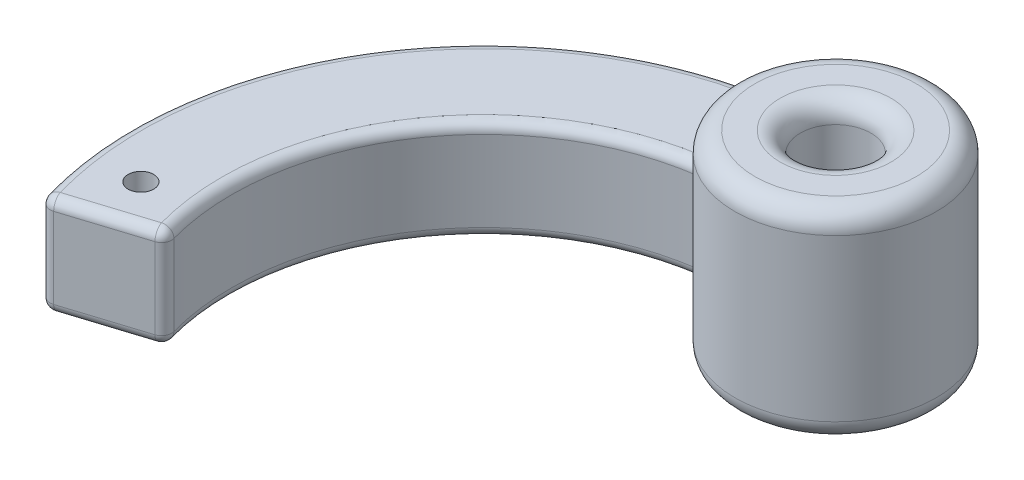
ISO-10303-21;
HEADER;
FILE_DESCRIPTION(('STEP AP214'),'2;1');
FILE_NAME('part.step','',(''),(''),'','','');
FILE_SCHEMA(('AUTOMOTIVE_DESIGN { 1 0 10303 214 1 1 1 1 }'));
ENDSEC;
DATA;
#1=APPLICATION_CONTEXT('core data for automotive mechanical design processes');
#2=APPLICATION_PROTOCOL_DEFINITION('international standard','automotive_design',2000,#1);
#3=PRODUCT_CONTEXT('',#1,'mechanical');
#4=PRODUCT('Part','Part','',(#3));
#5=PRODUCT_RELATED_PRODUCT_CATEGORY('part','',(#4));
#6=PRODUCT_DEFINITION_FORMATION('','',#4);
#7=PRODUCT_DEFINITION_CONTEXT('part definition',#1,'design');
#8=PRODUCT_DEFINITION('design','',#6,#7);
#9=PRODUCT_DEFINITION_SHAPE('','',#8);
#10=(LENGTH_UNIT() NAMED_UNIT(*) SI_UNIT(.MILLI.,.METRE.));
#11=(NAMED_UNIT(*) PLANE_ANGLE_UNIT() SI_UNIT($,.RADIAN.));
#12=(NAMED_UNIT(*) SI_UNIT($,.STERADIAN.) SOLID_ANGLE_UNIT());
#13=UNCERTAINTY_MEASURE_WITH_UNIT(LENGTH_MEASURE(1.E-05),#10,'distance_accuracy_value','');
#14=(GEOMETRIC_REPRESENTATION_CONTEXT(3) GLOBAL_UNCERTAINTY_ASSIGNED_CONTEXT((#13)) GLOBAL_UNIT_ASSIGNED_CONTEXT((#10,
#11,#12)) REPRESENTATION_CONTEXT('',''));
#15=CARTESIAN_POINT('',(0.,0.,0.));
#16=DIRECTION('',(0.,0.,1.));
#17=DIRECTION('',(1.,0.,0.));
#18=AXIS2_PLACEMENT_3D('',#15,#16,#17);
#19=CARTESIAN_POINT('',(33.3639521159744,-5.,-10.5757599822882));
#20=DIRECTION('',(0.,1.,0.));
#21=DIRECTION('',(0.,0.,1.));
#22=AXIS2_PLACEMENT_3D('',#19,#20,#21);
#23=CYLINDRICAL_SURFACE('',#22,25.);
#24=CARTESIAN_POINT('',(33.3639521159744,4.,-10.5757599822882));
#25=DIRECTION('',(0.,1.,0.));
#26=DIRECTION('',(0.,0.,1.));
#27=AXIS2_PLACEMENT_3D('',#24,#25,#26);
#28=CIRCLE('',#27,25.);
#29=CARTESIAN_POINT('',(29.9762636675065,4.,-35.345167867341));
#30=VERTEX_POINT('',#29);
#31=CARTESIAN_POINT('',(9.25964818534993,4.,-3.94382723081349));
#32=VERTEX_POINT('',#31);
#33=EDGE_CURVE('E217',#30,#32,#28,.T.);
#34=ORIENTED_EDGE('',*,*,#33,.T.);
#35=DIRECTION('',(0.,1.,0.));
#36=VECTOR('',#35,1.);
#37=CARTESIAN_POINT('',(9.25964818534993,-5.,-3.94382723081349));
#38=LINE('',#37,#36);
#39=CARTESIAN_POINT('',(9.25964818534993,-4.,-3.94382723081349));
#40=VERTEX_POINT('',#39);
#41=EDGE_CURVE('E402',#32,#40,#38,.F.);
#42=ORIENTED_EDGE('',*,*,#41,.T.);
#43=CARTESIAN_POINT('',(33.3639521159744,-4.,-10.5757599822882));
#44=DIRECTION('',(0.,1.,0.));
#45=DIRECTION('',(0.,0.,1.));
#46=AXIS2_PLACEMENT_3D('',#43,#44,#45);
#47=CIRCLE('',#46,25.);
#48=CARTESIAN_POINT('',(29.9762636675065,-4.,-35.345167867341));
#49=VERTEX_POINT('',#48);
#50=EDGE_CURVE('E221',#40,#49,#47,.F.);
#51=ORIENTED_EDGE('',*,*,#50,.T.);
#52=DIRECTION('',(0.,1.,0.));
#53=VECTOR('',#52,1.);
#54=CARTESIAN_POINT('',(29.9762636675065,0.,-35.345167867341));
#55=LINE('',#54,#53);
#56=EDGE_CURVE('E205',#30,#49,#55,.F.);
#57=ORIENTED_EDGE('',*,*,#56,.F.);
#58=EDGE_LOOP('',(#34,#42,#51,#57));
#59=FACE_BOUND('',#58,.T.);
#60=ADVANCED_FACE('F41',(#59),#23,.F.);
#61=CARTESIAN_POINT('',(9.53255774742125,-5.,-3.02164570922519));
#62=DIRECTION('',(-0.30216457092252,0.,-0.953255774742125));
#63=DIRECTION('',(-0.953255774742125,0.,0.30216457092252));
#64=AXIS2_PLACEMENT_3D('',#61,#62,#63);
#65=PLANE('',#64);
#66=DIRECTION('',(-0.953255774742125,0.,0.30216457092252));
#67=VECTOR('',#66,1.);
#68=CARTESIAN_POINT('',(9.53255774742125,-4.,-3.02164570922519));
#69=LINE('',#68,#67);
#70=CARTESIAN_POINT('',(0.967277275005183,-4.,-0.306609128955031));
#71=VERTEX_POINT('',#70);
#72=CARTESIAN_POINT('',(8.59764059904747,-4.,-2.72529414601238));
#73=VERTEX_POINT('',#72);
#74=EDGE_CURVE('E381',#71,#73,#69,.F.);
#75=ORIENTED_EDGE('',*,*,#74,.T.);
#76=DIRECTION('',(0.,-1.,0.));
#77=VECTOR('',#76,1.);
#78=CARTESIAN_POINT('',(8.59764059904747,4.,-2.72529414601238));
#79=LINE('',#78,#77);
#80=CARTESIAN_POINT('',(8.59764059904747,4.,-2.72529414601238));
#81=VERTEX_POINT('',#80);
#82=EDGE_CURVE('E398',#73,#81,#79,.F.);
#83=ORIENTED_EDGE('',*,*,#82,.T.);
#84=DIRECTION('',(-0.953255774742125,0.,0.30216457092252));
#85=VECTOR('',#84,1.);
#86=CARTESIAN_POINT('',(0.95325577474212,4.,-0.302164570922508));
#87=LINE('',#86,#85);
#88=CARTESIAN_POINT('',(0.967277275005183,4.,-0.306609128955031));
#89=VERTEX_POINT('',#88);
#90=EDGE_CURVE('E395',#81,#89,#87,.T.);
#91=ORIENTED_EDGE('',*,*,#90,.T.);
#92=DIRECTION('',(0.,1.,0.));
#93=VECTOR('',#92,1.);
#94=CARTESIAN_POINT('',(0.967277275005183,-5.,-0.306609128955031));
#95=LINE('',#94,#93);
#96=EDGE_CURVE('E386',#89,#71,#95,.F.);
#97=ORIENTED_EDGE('',*,*,#96,.T.);
#98=EDGE_LOOP('',(#75,#83,#91,#97));
#99=FACE_BOUND('',#98,.T.);
#100=ADVANCED_FACE('F351',(#99),#65,.F.);
#101=CARTESIAN_POINT('',(33.3639521159744,-5.,-10.5757599822882));
#102=DIRECTION('',(0.,1.,0.));
#103=DIRECTION('',(0.,0.,1.));
#104=AXIS2_PLACEMENT_3D('',#101,#102,#103);
#105=CYLINDRICAL_SURFACE('',#104,35.);
#106=CARTESIAN_POINT('',(33.3639521159744,-4.,-10.5757599822882));
#107=DIRECTION('',(0.,1.,0.));
#108=DIRECTION('',(0.,0.,1.));
#109=AXIS2_PLACEMENT_3D('',#106,#107,#108);
#110=CIRCLE('',#109,35.);
#111=CARTESIAN_POINT('',(30.3427227270843,-4.,-45.4451186368391));
#112=VERTEX_POINT('',#111);
#113=CARTESIAN_POINT('',(-0.29661786685533,-4.,-0.985867989620951));
#114=VERTEX_POINT('',#113);
#115=EDGE_CURVE('E233',#112,#114,#110,.T.);
#116=ORIENTED_EDGE('',*,*,#115,.T.);
#117=DIRECTION('',(0.,1.,0.));
#118=VECTOR('',#117,1.);
#119=CARTESIAN_POINT('',(-0.29661786685533,-5.,-0.985867989620953));
#120=LINE('',#119,#118);
#121=CARTESIAN_POINT('',(-0.29661786685533,4.,-0.985867989620951));
#122=VERTEX_POINT('',#121);
#123=EDGE_CURVE('E414',#114,#122,#120,.T.);
#124=ORIENTED_EDGE('',*,*,#123,.T.);
#125=CARTESIAN_POINT('',(33.3639521159744,4.,-10.5757599822882));
#126=DIRECTION('',(0.,1.,0.));
#127=DIRECTION('',(0.,0.,1.));
#128=AXIS2_PLACEMENT_3D('',#125,#126,#127);
#129=CIRCLE('',#128,35.);
#130=CARTESIAN_POINT('',(30.3427227270843,4.,-45.4451186368391));
#131=VERTEX_POINT('',#130);
#132=EDGE_CURVE('E230',#122,#131,#129,.F.);
#133=ORIENTED_EDGE('',*,*,#132,.T.);
#134=DIRECTION('',(0.,1.,0.));
#135=VECTOR('',#134,1.);
#136=CARTESIAN_POINT('',(30.3427227270843,0.,-45.4451186368391));
#137=LINE('',#136,#135);
#138=EDGE_CURVE('E196',#131,#112,#137,.F.);
#139=ORIENTED_EDGE('',*,*,#138,.T.);
#140=EDGE_LOOP('',(#116,#124,#133,#139));
#141=FACE_BOUND('',#140,.T.);
#142=ADVANCED_FACE('F356',(#141),#105,.T.);
#143=CARTESIAN_POINT('',(33.3639521159744,-5.,-10.5757599822882));
#144=DIRECTION('',(0.,1.,0.));
#145=DIRECTION('',(1.,0.,0.));
#146=AXIS2_PLACEMENT_3D('',#143,#144,#145);
#147=PLANE('',#146);
#148=DIRECTION('',(0.0938638724417828,0.,0.995585040792715));
#149=VECTOR('',#148,1.);
#150=CARTESIAN_POINT('',(6.64655947194127,-5.,-8.34830584974583));
#151=LINE('',#150,#149);
#152=CARTESIAN_POINT('',(5.49668668131593,-5.,-20.5446506135014));
#153=VERTEX_POINT('',#152);
#154=CARTESIAN_POINT('',(6.64655947194127,-5.,-8.34830584974583));
#155=VERTEX_POINT('',#154);
#156=EDGE_CURVE('E187',#153,#155,#151,.T.);
#157=ORIENTED_EDGE('',*,*,#156,.F.);
#158=CARTESIAN_POINT('',(3.57480931856967,-5.,-20.3634557941398));
#159=DIRECTION('',(0.,-1.,0.));
#160=DIRECTION('',(0.,0.,-1.));
#161=AXIS2_PLACEMENT_3D('',#158,#159,#160);
#162=CIRCLE('',#161,1.9304);
#163=CARTESIAN_POINT('',(1.64899594382902,-5.,-20.4964482964474));
#164=VERTEX_POINT('',#163);
#165=EDGE_CURVE('E151',#164,#153,#162,.T.);
#166=ORIENTED_EDGE('',*,*,#165,.F.);
#167=DIRECTION('',(0.0688937537855013,0.,-0.997624002662999));
#168=VECTOR('',#167,1.);
#169=CARTESIAN_POINT('',(1.64899594382902,-5.,-20.4964482964474));
#170=LINE('',#169,#168);
#171=CARTESIAN_POINT('',(0.805017841699006,-5.,-8.27512537320641));
#172=VERTEX_POINT('',#171);
#173=EDGE_CURVE('E171',#172,#164,#170,.T.);
#174=ORIENTED_EDGE('',*,*,#173,.F.);
#175=CARTESIAN_POINT('',(3.75256321794351,-5.,-6.17446916502296));
#176=DIRECTION('',(0.,-1.,0.));
#177=DIRECTION('',(0.,0.,-1.));
#178=AXIS2_PLACEMENT_3D('',#175,#176,#177);
#179=CIRCLE('',#178,3.6195);
#180=EDGE_CURVE('E175',#155,#172,#179,.T.);
#181=ORIENTED_EDGE('',*,*,#180,.F.);
#182=EDGE_LOOP('',(#157,#166,#174,#181));
#183=FACE_BOUND('',#182,.T.);
#184=CARTESIAN_POINT('',(33.3639521159744,-5.,-10.5757599822882));
#185=DIRECTION('',(0.,1.,0.));
#186=DIRECTION('',(0.,0.,1.));
#187=AXIS2_PLACEMENT_3D('',#184,#185,#186);
#188=CIRCLE('',#187,26.);
#189=CARTESIAN_POINT('',(29.5294442961109,-5.,-36.2914468247469));
#190=VERTEX_POINT('',#189);
#191=CARTESIAN_POINT('',(8.29547602812496,-5.,-3.6785499207545));
#192=VERTEX_POINT('',#191);
#193=EDGE_CURVE('E227',#190,#192,#188,.T.);
#194=ORIENTED_EDGE('',*,*,#193,.T.);
#195=DIRECTION('',(-0.953255774742125,0.,0.30216457092252));
#196=VECTOR('',#195,1.);
#197=CARTESIAN_POINT('',(33.0617875450519,-5.,-11.5290157570303));
#198=LINE('',#197,#196);
#199=CARTESIAN_POINT('',(0.665112704082663,-5.,-1.25986490369715));
#200=VERTEX_POINT('',#199);
#201=EDGE_CURVE('E11',#192,#200,#198,.T.);
#202=ORIENTED_EDGE('',*,*,#201,.T.);
#203=CARTESIAN_POINT('',(33.3639521159744,-5.,-10.5757599822882));
#204=DIRECTION('',(0.,1.,0.));
#205=DIRECTION('',(0.,0.,1.));
#206=AXIS2_PLACEMENT_3D('',#203,#204,#205);
#207=CIRCLE('',#206,34.);
#208=CARTESIAN_POINT('',(29.7554985274123,-5.,-44.3837333421214));
#209=VERTEX_POINT('',#208);
#210=EDGE_CURVE('E224',#200,#209,#207,.F.);
#211=ORIENTED_EDGE('',*,*,#210,.T.);
#212=CARTESIAN_POINT('',(38.7830814445411,-5.,-40.0822514260412));
#213=DIRECTION('',(0.,1.,0.));
#214=DIRECTION('',(0.,0.,1.));
#215=AXIS2_PLACEMENT_3D('',#212,#213,#214);
#216=CIRCLE('',#215,10.);
#217=EDGE_CURVE('E209',#209,#190,#216,.T.);
#218=ORIENTED_EDGE('',*,*,#217,.T.);
#219=EDGE_LOOP('',(#194,#202,#211,#218));
#220=FACE_BOUND('',#219,.T.);
#221=ADVANCED_FACE('F361',(#183,#220),#147,.F.);
#222=CARTESIAN_POINT('',(33.3639521159744,5.,-10.5757599822882));
#223=DIRECTION('',(0.,1.,0.));
#224=DIRECTION('',(1.,0.,0.));
#225=AXIS2_PLACEMENT_3D('',#222,#223,#224);
#226=PLANE('',#225);
#227=CARTESIAN_POINT('',(3.75256321794351,5.,-6.17446916502296));
#228=DIRECTION('',(0.,1.,0.));
#229=DIRECTION('',(0.,0.,1.));
#230=AXIS2_PLACEMENT_3D('',#227,#228,#229);
#231=CIRCLE('',#230,1.27);
#232=CARTESIAN_POINT('',(3.75256321794351,5.,-4.90446916502296));
#233=VERTEX_POINT('',#232);
#234=EDGE_CURVE('E178',#233,#233,#231,.T.);
#235=ORIENTED_EDGE('',*,*,#234,.F.);
#236=EDGE_LOOP('',(#235));
#237=FACE_BOUND('',#236,.T.);
#238=CARTESIAN_POINT('',(33.3639521159744,5.,-10.5757599822882));
#239=DIRECTION('',(0.,1.,0.));
#240=DIRECTION('',(0.,0.,1.));
#241=AXIS2_PLACEMENT_3D('',#238,#239,#240);
#242=CIRCLE('',#241,34.);
#243=CARTESIAN_POINT('',(29.7554985274123,5.,-44.3837333421214));
#244=VERTEX_POINT('',#243);
#245=CARTESIAN_POINT('',(0.665112704082663,5.,-1.25986490369716));
#246=VERTEX_POINT('',#245);
#247=EDGE_CURVE('E239',#244,#246,#242,.T.);
#248=ORIENTED_EDGE('',*,*,#247,.T.);
#249=DIRECTION('',(-0.953255774742125,0.,0.30216457092252));
#250=VECTOR('',#249,1.);
#251=CARTESIAN_POINT('',(8.27713740175661,5.,-3.6727369130448));
#252=LINE('',#251,#250);
#253=CARTESIAN_POINT('',(8.29547602812496,5.,-3.67854992075451));
#254=VERTEX_POINT('',#253);
#255=EDGE_CURVE('E408',#246,#254,#252,.F.);
#256=ORIENTED_EDGE('',*,*,#255,.T.);
#257=CARTESIAN_POINT('',(33.3639521159744,5.,-10.5757599822882));
#258=DIRECTION('',(0.,1.,0.));
#259=DIRECTION('',(0.,0.,1.));
#260=AXIS2_PLACEMENT_3D('',#257,#258,#259);
#261=CIRCLE('',#260,26.);
#262=CARTESIAN_POINT('',(29.5294442961109,5.,-36.2914468247469));
#263=VERTEX_POINT('',#262);
#264=EDGE_CURVE('E236',#254,#263,#261,.F.);
#265=ORIENTED_EDGE('',*,*,#264,.T.);
#266=CARTESIAN_POINT('',(38.7830814445411,5.,-40.0822514260412));
#267=DIRECTION('',(0.,1.,0.));
#268=DIRECTION('',(0.,0.,1.));
#269=AXIS2_PLACEMENT_3D('',#266,#267,#268);
#270=CIRCLE('',#269,10.);
#271=EDGE_CURVE('E213',#244,#263,#270,.T.);
#272=ORIENTED_EDGE('',*,*,#271,.F.);
#273=EDGE_LOOP('',(#248,#256,#265,#272));
#274=FACE_BOUND('',#273,.T.);
#275=ADVANCED_FACE('F268',(#237,#274),#226,.T.);
#276=CARTESIAN_POINT('',(38.7830814445411,-10.,-40.0822514260412));
#277=DIRECTION('',(0.,1.,0.));
#278=DIRECTION('',(0.,0.,1.));
#279=AXIS2_PLACEMENT_3D('',#276,#277,#278);
#280=CYLINDRICAL_SURFACE('',#279,10.);
#281=CARTESIAN_POINT('',(38.7830814445411,-8.,-40.0822514260412));
#282=DIRECTION('',(0.,1.,0.));
#283=DIRECTION('',(0.,0.,1.));
#284=AXIS2_PLACEMENT_3D('',#281,#282,#283);
#285=CIRCLE('',#284,10.);
#286=CARTESIAN_POINT('',(38.7830814445411,-8.,-30.0822514260412));
#287=VERTEX_POINT('',#286);
#288=EDGE_CURVE('E476',#287,#287,#285,.T.);
#289=ORIENTED_EDGE('',*,*,#288,.T.);
#290=EDGE_LOOP('',(#289));
#291=FACE_BOUND('',#290,.T.);
#292=CARTESIAN_POINT('',(38.7830814445411,8.,-40.0822514260412));
#293=DIRECTION('',(0.,1.,0.));
#294=DIRECTION('',(0.,0.,1.));
#295=AXIS2_PLACEMENT_3D('',#292,#293,#294);
#296=CIRCLE('',#295,10.);
#297=CARTESIAN_POINT('',(38.7830814445411,8.,-30.0822514260412));
#298=VERTEX_POINT('',#297);
#299=EDGE_CURVE('E473',#298,#298,#296,.F.);
#300=ORIENTED_EDGE('',*,*,#299,.T.);
#301=EDGE_LOOP('',(#300));
#302=FACE_BOUND('',#301,.T.);
#303=ORIENTED_EDGE('',*,*,#217,.F.);
#304=CARTESIAN_POINT('',(29.7554985274123,-5.,-44.3837333421214));
#305=CARTESIAN_POINT('',(29.7737877796549,-4.99999360922721,-44.4221208554838));
#306=CARTESIAN_POINT('',(29.7923115824745,-4.99803047159358,-44.4603618366501));
#307=CARTESIAN_POINT('',(29.8296868430262,-4.99024424863939,-44.5362960017802));
#308=CARTESIAN_POINT('',(29.8485383606271,-4.98442045065814,-44.5739890832912));
#309=CARTESIAN_POINT('',(29.905541940391,-4.96116608517271,-44.6861973089875));
#310=CARTESIAN_POINT('',(29.9439664407812,-4.93795346009036,-44.7594715401606));
#311=CARTESIAN_POINT('',(30.0164634371884,-4.87927037485164,-44.8938778204202));
#312=CARTESIAN_POINT('',(30.0506236395329,-4.84504262203348,-44.9555116050041));
#313=CARTESIAN_POINT('',(30.1164163007152,-4.76437279474406,-45.0715730991394));
#314=CARTESIAN_POINT('',(30.1480566744784,-4.71797110524415,-45.1260237562505));
#315=CARTESIAN_POINT('',(30.1984409941347,-4.62811874993429,-45.2111572124866));
#316=CARTESIAN_POINT('',(30.2183045233795,-4.58753081964156,-45.2442109537918));
#317=CARTESIAN_POINT('',(30.2546822524723,-4.50057742729908,-45.3040932435931));
#318=CARTESIAN_POINT('',(30.2711964894788,-4.45421202935609,-45.3309218611536));
#319=CARTESIAN_POINT('',(30.2998818251541,-4.35604595747345,-45.3771620001622));
#320=CARTESIAN_POINT('',(30.3120093087297,-4.3041969892233,-45.3964991658061));
#321=CARTESIAN_POINT('',(30.3305498063417,-4.19702740192306,-45.4259413494355));
#322=CARTESIAN_POINT('',(30.3369805721618,-4.14171814653333,-45.4360750492394));
#323=CARTESIAN_POINT('',(30.341061069333,-4.07160978950433,-45.4425025102147));
#324=CARTESIAN_POINT('',(30.3416838978203,-4.05730436158891,-45.4434832958274));
#325=CARTESIAN_POINT('',(30.3425140031407,-4.02866838915537,-45.4447902620585));
#326=CARTESIAN_POINT('',(30.3427217659588,-4.01433789369726,-45.4451172082339));
#327=CARTESIAN_POINT('',(30.3427227270843,-4.,-45.4451186368391));
#328=B_SPLINE_CURVE_WITH_KNOTS('',3,(#304,#305,#306,#307,#308,#309,#310,#311,#312,#313,#314,
#315,#316,#317,#318,#319,#320,#321,#322,#323,#324,#325,#326,#327),.UNSPECIFIED.,.F.,.F.,(4,2,2,
2,2,2,2,2,2,2,2,4),(0.,0.127459185301026,0.254941905553653,0.511118864914481,0.744999322571644,
0.978113521751211,1.14544058189423,1.31276578554229,1.48171163339287,1.65012915097415,
1.69317328981779,1.73616700026528),.UNSPECIFIED.);
#329=EDGE_CURVE('E252',#209,#112,#328,.T.);
#330=ORIENTED_EDGE('',*,*,#329,.T.);
#331=ORIENTED_EDGE('',*,*,#138,.F.);
#332=CARTESIAN_POINT('',(30.3427227270843,4.,-45.4451186368391));
#333=CARTESIAN_POINT('',(30.3427250405433,4.02423511268571,-45.4451211343915));
#334=CARTESIAN_POINT('',(30.3421275747217,4.04845641806032,-45.4441820553324));
#335=CARTESIAN_POINT('',(30.3397600247948,4.09668482827756,-45.4404536294317));
#336=CARTESIAN_POINT('',(30.3379906144693,4.12069204817042,-45.4376653457426));
#337=CARTESIAN_POINT('',(30.3309978753994,4.19180813126846,-45.4266281314307));
#338=CARTESIAN_POINT('',(30.3240891775969,4.23836898032929,-45.4157057409729));
#339=CARTESIAN_POINT('',(30.3063118014701,4.3285191467139,-45.3874045645715));
#340=CARTESIAN_POINT('',(30.2954508011898,4.37211403234506,-45.370038295719));
#341=CARTESIAN_POINT('',(30.2704483964787,4.45566153193307,-45.3296928129781));
#342=CARTESIAN_POINT('',(30.256302024541,4.4956085014923,-45.3067050966027));
#343=CARTESIAN_POINT('',(30.2242034620526,4.57433645902372,-45.2539661061282));
#344=CARTESIAN_POINT('',(30.2060359607208,4.6127616467408,-45.2238180996652));
#345=CARTESIAN_POINT('',(30.1675336881793,4.68434591832574,-45.1590377353089));
#346=CARTESIAN_POINT('',(30.1471984628651,4.71750389515763,-45.1244044374888));
#347=CARTESIAN_POINT('',(30.1008748464643,4.78444540212609,-45.0442894955576));
#348=CARTESIAN_POINT('',(30.0745632246661,4.81705875093017,-44.9980162998391));
#349=CARTESIAN_POINT('',(30.020746328085,4.87445312104549,-44.9014382087345));
#350=CARTESIAN_POINT('',(29.9932395623172,4.89922401983678,-44.8511282069818));
#351=CARTESIAN_POINT('',(29.9303274886401,4.94642703368937,-44.7335145017952));
#352=CARTESIAN_POINT('',(29.8947946117493,4.96642234372213,-44.6652897969661));
#353=CARTESIAN_POINT('',(29.8243661654007,4.99319173368373,-44.5260904274907));
#354=CARTESIAN_POINT('',(29.7894698420462,4.99998261632771,-44.4551193751005));
#355=CARTESIAN_POINT('',(29.7554985274123,5.,-44.3837333421214));
#356=B_SPLINE_CURVE_WITH_KNOTS('',3,(#332,#333,#334,#335,#336,#337,#338,#339,#340,#341,#342,
#343,#344,#345,#346,#347,#348,#349,#350,#351,#352,#353,#354,#355),.UNSPECIFIED.,.F.,.F.,(4,2,2,
2,2,2,2,2,2,2,2,4),(0.,0.0726533836976991,0.14526503337794,0.289431342533313,0.43331906545865,
0.577425780668382,0.733191239470694,0.888989393084181,1.07556217601326,1.26237480223903,
1.49962130841371,1.73656571886483),.UNSPECIFIED.);
#357=EDGE_CURVE('E276',#131,#244,#356,.T.);
#358=ORIENTED_EDGE('',*,*,#357,.T.);
#359=ORIENTED_EDGE('',*,*,#271,.T.);
#360=CARTESIAN_POINT('',(29.5294442961109,5.,-36.2914468247469));
#361=CARTESIAN_POINT('',(29.5522143987659,5.00003642569303,-36.2358093088811));
#362=CARTESIAN_POINT('',(29.575511442181,4.99488953154825,-36.1804219813501));
#363=CARTESIAN_POINT('',(29.6223791122289,4.9746673543613,-36.0716494120357));
#364=CARTESIAN_POINT('',(29.6459495506263,4.95959854535888,-36.0182628887208));
#365=CARTESIAN_POINT('',(29.6926174550851,4.91996795533419,-35.914912712044));
#366=CARTESIAN_POINT('',(29.7157148791368,4.89540533495725,-35.8649493617873));
#367=CARTESIAN_POINT('',(29.7605896349506,4.83743830559713,-35.7697806925922));
#368=CARTESIAN_POINT('',(29.7823669939076,4.80403407883725,-35.7245752756209));
#369=CARTESIAN_POINT('',(29.8237354273308,4.72914878606558,-35.6401418968567));
#370=CARTESIAN_POINT('',(29.8433239527497,4.68765845433319,-35.6009208852905));
#371=CARTESIAN_POINT('',(29.8793624579331,4.59764863229827,-35.5297374271098));
#372=CARTESIAN_POINT('',(29.8958124164353,4.54912909438037,-35.4977750296685));
#373=CARTESIAN_POINT('',(29.9241361411483,4.44831114466008,-35.4432860603981));
#374=CARTESIAN_POINT('',(29.9361568591898,4.39621930965345,-35.420453798079));
#375=CARTESIAN_POINT('',(29.9557394744298,4.28828461402679,-35.3834773990357));
#376=CARTESIAN_POINT('',(29.9633079884662,4.23244745797991,-35.3693203679241));
#377=CARTESIAN_POINT('',(29.9710189636018,4.14671334250064,-35.3549284888238));
#378=CARTESIAN_POINT('',(29.9729829891893,4.11750859418476,-35.3512708805272));
#379=CARTESIAN_POINT('',(29.9756053697785,4.05887474649126,-35.3463915404211));
#380=CARTESIAN_POINT('',(29.9762653347722,4.02944596884144,-35.345166804979));
#381=CARTESIAN_POINT('',(29.9762636675065,4.,-35.345167867341));
#382=B_SPLINE_CURVE_WITH_KNOTS('',3,(#360,#361,#362,#363,#364,#365,#366,#367,#368,#369,#370,
#371,#372,#373,#374,#375,#376,#377,#378,#379,#380,#381),.UNSPECIFIED.,.F.,.F.,(4,2,2,2,2,2,2,2,
2,2,4),(0.,0.180083181465528,0.360048975120294,0.54003068332063,0.720008682431562,
0.900194140669579,1.08038081952904,1.25389239741659,1.42714544767743,1.51552614220267,
1.60379765365632),.UNSPECIFIED.);
#383=EDGE_CURVE('E283',#263,#30,#382,.T.);
#384=ORIENTED_EDGE('',*,*,#383,.T.);
#385=ORIENTED_EDGE('',*,*,#56,.T.);
#386=CARTESIAN_POINT('',(29.9762636675065,-4.,-35.345167867341));
#387=CARTESIAN_POINT('',(29.976264765316,-4.02697377358882,-35.3451672305988));
#388=CARTESIAN_POINT('',(29.9757113167535,-4.05393398706053,-35.3461946095288));
#389=CARTESIAN_POINT('',(29.9735111537766,-4.10764855803688,-35.3502878427343));
#390=CARTESIAN_POINT('',(29.9718646754278,-4.13440295872979,-35.3533532568482));
#391=CARTESIAN_POINT('',(29.9653249939189,-4.21391327071841,-35.3655511843317));
#392=CARTESIAN_POINT('',(29.9588312947524,-4.26611541554091,-35.3776856845309));
#393=CARTESIAN_POINT('',(29.9419369647349,-4.36743236256412,-35.4095130462271));
#394=CARTESIAN_POINT('',(29.9315375892066,-4.41654815083556,-35.4292034792173));
#395=CARTESIAN_POINT('',(29.9073609577008,-4.51052805075982,-35.4754884127319));
#396=CARTESIAN_POINT('',(29.8935822013936,-4.55539026166956,-35.5020859800972));
#397=CARTESIAN_POINT('',(29.8627955474448,-4.64115754332933,-35.5623314791138));
#398=CARTESIAN_POINT('',(29.8456993370187,-4.68189268202054,-35.5961757132114));
#399=CARTESIAN_POINT('',(29.8093010777292,-4.75685299820135,-35.6694362630393));
#400=CARTESIAN_POINT('',(29.789998280818,-4.79107595747875,-35.7088544694638));
#401=CARTESIAN_POINT('',(29.7487816326424,-4.85400609638589,-35.7946167272549));
#402=CARTESIAN_POINT('',(29.7267821117192,-4.88229739777814,-35.8412249221171));
#403=CARTESIAN_POINT('',(29.6819334453859,-4.93013627655815,-35.9383446330662));
#404=CARTESIAN_POINT('',(29.6590845375972,-4.94968627973477,-35.9888550616793));
#405=CARTESIAN_POINT('',(29.6182316610877,-4.9763136822214,-36.0813141066364));
#406=CARTESIAN_POINT('',(29.6002430847315,-4.98516969634365,-36.122766386933));
#407=CARTESIAN_POINT('',(29.5645525215585,-4.9970153174524,-36.2065796657645));
#408=CARTESIAN_POINT('',(29.5468503141836,-5.00000967548139,-36.2489399001965));
#409=CARTESIAN_POINT('',(29.5294442961109,-5.,-36.2914468247469));
#410=B_SPLINE_CURVE_WITH_KNOTS('',3,(#386,#387,#388,#389,#390,#391,#392,#393,#394,#395,#396,
#397,#398,#399,#400,#401,#402,#403,#404,#405,#406,#407,#408,#409),.UNSPECIFIED.,.F.,.F.,(4,2,2,
2,2,2,2,2,2,2,2,4),(0.,0.0808695002507469,0.16172154050651,0.322836158046486,0.483899036019814,
0.645033550257889,0.811262022020828,0.97754701442402,1.15313812047472,1.3286804681254,
1.46645079778683,1.60410941428333),.UNSPECIFIED.);
#411=EDGE_CURVE('E243',#49,#190,#410,.T.);
#412=ORIENTED_EDGE('',*,*,#411,.T.);
#413=EDGE_LOOP('',(#303,#330,#331,#358,#359,#384,#385,#412));
#414=FACE_BOUND('',#413,.T.);
#415=ADVANCED_FACE('F262',(#291,#302,#414),#280,.T.);
#416=CARTESIAN_POINT('',(38.7830814445411,-10.,-40.0822514260412));
#417=DIRECTION('',(0.,1.,0.));
#418=DIRECTION('',(0.,0.,1.));
#419=AXIS2_PLACEMENT_3D('',#416,#417,#418);
#420=PLANE('',#419);
#421=CARTESIAN_POINT('',(38.7830814445411,-10.,-40.0822514260412));
#422=DIRECTION('',(0.,1.,0.));
#423=DIRECTION('',(0.,0.,1.));
#424=AXIS2_PLACEMENT_3D('',#421,#422,#423);
#425=CIRCLE('',#424,5.50000000000001);
#426=CARTESIAN_POINT('',(38.7830814445411,-10.,-34.5822514260412));
#427=VERTEX_POINT('',#426);
#428=EDGE_CURVE('E389',#427,#427,#425,.T.);
#429=ORIENTED_EDGE('',*,*,#428,.T.);
#430=EDGE_LOOP('',(#429));
#431=FACE_BOUND('',#430,.T.);
#432=CARTESIAN_POINT('',(38.7830814445411,-10.,-40.0822514260412));
#433=DIRECTION('',(0.,1.,0.));
#434=DIRECTION('',(0.,0.,1.));
#435=AXIS2_PLACEMENT_3D('',#432,#433,#434);
#436=CIRCLE('',#435,8.);
#437=CARTESIAN_POINT('',(38.7830814445411,-10.,-32.0822514260412));
#438=VERTEX_POINT('',#437);
#439=EDGE_CURVE('E481',#438,#438,#436,.F.);
#440=ORIENTED_EDGE('',*,*,#439,.T.);
#441=EDGE_LOOP('',(#440));
#442=FACE_BOUND('',#441,.T.);
#443=ADVANCED_FACE('F267',(#431,#442),#420,.F.);
#444=CARTESIAN_POINT('',(38.7830814445411,10.,-40.0822514260412));
#445=DIRECTION('',(0.,1.,0.));
#446=DIRECTION('',(0.,0.,1.));
#447=AXIS2_PLACEMENT_3D('',#444,#445,#446);
#448=PLANE('',#447);
#449=CARTESIAN_POINT('',(38.7830814445411,10.,-40.0822514260412));
#450=DIRECTION('',(0.,1.,0.));
#451=DIRECTION('',(0.,0.,1.));
#452=AXIS2_PLACEMENT_3D('',#449,#450,#451);
#453=CIRCLE('',#452,5.50000000000001);
#454=CARTESIAN_POINT('',(38.7830814445411,10.,-34.5822514260412));
#455=VERTEX_POINT('',#454);
#456=EDGE_CURVE('E382',#455,#455,#453,.F.);
#457=ORIENTED_EDGE('',*,*,#456,.T.);
#458=EDGE_LOOP('',(#457));
#459=FACE_BOUND('',#458,.T.);
#460=CARTESIAN_POINT('',(38.7830814445411,10.,-40.0822514260412));
#461=DIRECTION('',(0.,1.,0.));
#462=DIRECTION('',(0.,0.,1.));
#463=AXIS2_PLACEMENT_3D('',#460,#461,#462);
#464=CIRCLE('',#463,8.);
#465=CARTESIAN_POINT('',(38.7830814445411,10.,-32.0822514260412));
#466=VERTEX_POINT('',#465);
#467=EDGE_CURVE('E487',#466,#466,#464,.T.);
#468=ORIENTED_EDGE('',*,*,#467,.T.);
#469=EDGE_LOOP('',(#468));
#470=FACE_BOUND('',#469,.T.);
#471=ADVANCED_FACE('F515',(#459,#470),#448,.T.);
#472=CARTESIAN_POINT('',(33.3639521159744,-4.,-10.5757599822882));
#473=DIRECTION('',(0.,1.,0.));
#474=DIRECTION('',(0.,0.,1.));
#475=AXIS2_PLACEMENT_3D('',#472,#473,#474);
#476=TOROIDAL_SURFACE('',#475,26.,1.);
#477=ORIENTED_EDGE('',*,*,#50,.F.);
#478=CARTESIAN_POINT('',(8.29547602812496,-4.,-3.67854992075451));
#479=DIRECTION('',(0.265277310058987,0.,0.964172157224978));
#480=DIRECTION('',(0.964172157224978,0.,-0.265277310058987));
#481=AXIS2_PLACEMENT_3D('',#478,#479,#480);
#482=CIRCLE('',#481,1.);
#483=EDGE_CURVE('E377',#40,#192,#482,.F.);
#484=ORIENTED_EDGE('',*,*,#483,.T.);
#485=ORIENTED_EDGE('',*,*,#193,.F.);
#486=ORIENTED_EDGE('',*,*,#411,.F.);
#487=EDGE_LOOP('',(#477,#484,#485,#486));
#488=FACE_BOUND('',#487,.T.);
#489=ADVANCED_FACE('F259',(#488),#476,.T.);
#490=CARTESIAN_POINT('',(33.3639521159744,-4.,-10.5757599822882));
#491=DIRECTION('',(0.,1.,0.));
#492=DIRECTION('',(0.,0.,1.));
#493=AXIS2_PLACEMENT_3D('',#490,#491,#492);
#494=TOROIDAL_SURFACE('',#493,34.,1.);
#495=ORIENTED_EDGE('',*,*,#210,.F.);
#496=CARTESIAN_POINT('',(0.665112704082663,-4.,-1.25986490369716));
#497=DIRECTION('',(0.273996914076206,0.,0.961730570937992));
#498=DIRECTION('',(0.961730570937992,0.,-0.273996914076206));
#499=AXIS2_PLACEMENT_3D('',#496,#497,#498);
#500=CIRCLE('',#499,1.);
#501=EDGE_CURVE('E51',#200,#114,#500,.F.);
#502=ORIENTED_EDGE('',*,*,#501,.T.);
#503=ORIENTED_EDGE('',*,*,#115,.F.);
#504=ORIENTED_EDGE('',*,*,#329,.F.);
#505=EDGE_LOOP('',(#495,#502,#503,#504));
#506=FACE_BOUND('',#505,.T.);
#507=ADVANCED_FACE('F294',(#506),#494,.T.);
#508=CARTESIAN_POINT('',(33.3639521159744,4.,-10.5757599822882));
#509=DIRECTION('',(0.,1.,0.));
#510=DIRECTION('',(0.,0.,1.));
#511=AXIS2_PLACEMENT_3D('',#508,#509,#510);
#512=TOROIDAL_SURFACE('',#511,34.,1.);
#513=ORIENTED_EDGE('',*,*,#132,.F.);
#514=CARTESIAN_POINT('',(0.665112704082663,4.,-1.25986490369716));
#515=DIRECTION('',(0.273996914076206,0.,0.961730570937992));
#516=DIRECTION('',(0.961730570937992,0.,-0.273996914076206));
#517=AXIS2_PLACEMENT_3D('',#514,#515,#516);
#518=CIRCLE('',#517,1.);
#519=EDGE_CURVE('E411',#122,#246,#518,.F.);
#520=ORIENTED_EDGE('',*,*,#519,.T.);
#521=ORIENTED_EDGE('',*,*,#247,.F.);
#522=ORIENTED_EDGE('',*,*,#357,.F.);
#523=EDGE_LOOP('',(#513,#520,#521,#522));
#524=FACE_BOUND('',#523,.T.);
#525=ADVANCED_FACE('F290',(#524),#512,.T.);
#526=CARTESIAN_POINT('',(33.3639521159744,4.,-10.5757599822882));
#527=DIRECTION('',(0.,1.,0.));
#528=DIRECTION('',(0.,0.,1.));
#529=AXIS2_PLACEMENT_3D('',#526,#527,#528);
#530=TOROIDAL_SURFACE('',#529,26.,1.);
#531=ORIENTED_EDGE('',*,*,#264,.F.);
#532=CARTESIAN_POINT('',(8.29547602812496,4.,-3.67854992075451));
#533=DIRECTION('',(0.265277310058987,0.,0.964172157224978));
#534=DIRECTION('',(0.964172157224978,0.,-0.265277310058987));
#535=AXIS2_PLACEMENT_3D('',#532,#533,#534);
#536=CIRCLE('',#535,1.);
#537=EDGE_CURVE('E405',#254,#32,#536,.F.);
#538=ORIENTED_EDGE('',*,*,#537,.T.);
#539=ORIENTED_EDGE('',*,*,#33,.F.);
#540=ORIENTED_EDGE('',*,*,#383,.F.);
#541=EDGE_LOOP('',(#531,#538,#539,#540));
#542=FACE_BOUND('',#541,.T.);
#543=ADVANCED_FACE('F293',(#542),#530,.T.);
#544=CARTESIAN_POINT('',(38.7830814445411,-8.,-40.0822514260412));
#545=DIRECTION('',(0.,1.,0.));
#546=DIRECTION('',(0.,0.,1.));
#547=AXIS2_PLACEMENT_3D('',#544,#545,#546);
#548=TOROIDAL_SURFACE('',#547,8.,2.);
#549=ORIENTED_EDGE('',*,*,#439,.F.);
#550=EDGE_LOOP('',(#549));
#551=FACE_BOUND('',#550,.T.);
#552=ORIENTED_EDGE('',*,*,#288,.F.);
#553=EDGE_LOOP('',(#552));
#554=FACE_BOUND('',#553,.T.);
#555=ADVANCED_FACE('F300',(#551,#554),#548,.T.);
#556=CARTESIAN_POINT('',(38.7830814445411,8.,-40.0822514260412));
#557=DIRECTION('',(0.,1.,0.));
#558=DIRECTION('',(0.,0.,1.));
#559=AXIS2_PLACEMENT_3D('',#556,#557,#558);
#560=TOROIDAL_SURFACE('',#559,8.,2.);
#561=ORIENTED_EDGE('',*,*,#299,.F.);
#562=EDGE_LOOP('',(#561));
#563=FACE_BOUND('',#562,.T.);
#564=ORIENTED_EDGE('',*,*,#467,.F.);
#565=EDGE_LOOP('',(#564));
#566=FACE_BOUND('',#565,.T.);
#567=ADVANCED_FACE('F304',(#563,#566),#560,.T.);
#568=CARTESIAN_POINT('',(38.7830814445411,-19.8994949366117,-40.0822514260412));
#569=DIRECTION('',(0.,1.,0.));
#570=DIRECTION('',(0.,0.,1.));
#571=AXIS2_PLACEMENT_3D('',#568,#569,#570);
#572=CYLINDRICAL_SURFACE('',#571,3.50000000000001);
#573=CARTESIAN_POINT('',(38.7830814445411,-8.,-40.0822514260412));
#574=DIRECTION('',(0.,1.,0.));
#575=DIRECTION('',(0.,0.,1.));
#576=AXIS2_PLACEMENT_3D('',#573,#574,#575);
#577=CIRCLE('',#576,3.50000000000001);
#578=CARTESIAN_POINT('',(38.7830814445411,-8.,-36.5822514260412));
#579=VERTEX_POINT('',#578);
#580=EDGE_CURVE('E495',#579,#579,#577,.F.);
#581=ORIENTED_EDGE('',*,*,#580,.T.);
#582=EDGE_LOOP('',(#581));
#583=FACE_BOUND('',#582,.T.);
#584=CARTESIAN_POINT('',(38.7830814445411,8.,-40.0822514260412));
#585=DIRECTION('',(0.,1.,0.));
#586=DIRECTION('',(0.,0.,1.));
#587=AXIS2_PLACEMENT_3D('',#584,#585,#586);
#588=CIRCLE('',#587,3.50000000000001);
#589=CARTESIAN_POINT('',(38.7830814445411,8.,-36.5822514260412));
#590=VERTEX_POINT('',#589);
#591=EDGE_CURVE('E491',#590,#590,#588,.T.);
#592=ORIENTED_EDGE('',*,*,#591,.T.);
#593=EDGE_LOOP('',(#592));
#594=FACE_BOUND('',#593,.T.);
#595=ADVANCED_FACE('F308',(#583,#594),#572,.F.);
#596=CARTESIAN_POINT('',(38.7830814445411,-8.,-40.0822514260412));
#597=DIRECTION('',(0.,1.,0.));
#598=DIRECTION('',(0.,0.,1.));
#599=AXIS2_PLACEMENT_3D('',#596,#597,#598);
#600=TOROIDAL_SURFACE('',#599,5.50000000000001,2.);
#601=ORIENTED_EDGE('',*,*,#428,.F.);
#602=EDGE_LOOP('',(#601));
#603=FACE_BOUND('',#602,.T.);
#604=ORIENTED_EDGE('',*,*,#580,.F.);
#605=EDGE_LOOP('',(#604));
#606=FACE_BOUND('',#605,.T.);
#607=ADVANCED_FACE('F310',(#603,#606),#600,.T.);
#608=CARTESIAN_POINT('',(38.7830814445411,8.,-40.0822514260412));
#609=DIRECTION('',(0.,1.,0.));
#610=DIRECTION('',(0.,0.,1.));
#611=AXIS2_PLACEMENT_3D('',#608,#609,#610);
#612=TOROIDAL_SURFACE('',#611,5.50000000000001,2.);
#613=ORIENTED_EDGE('',*,*,#456,.F.);
#614=EDGE_LOOP('',(#613));
#615=FACE_BOUND('',#614,.T.);
#616=ORIENTED_EDGE('',*,*,#591,.F.);
#617=EDGE_LOOP('',(#616));
#618=FACE_BOUND('',#617,.T.);
#619=ADVANCED_FACE('F313',(#615,#618),#612,.T.);
#620=CARTESIAN_POINT('',(3.57480931856967,-1.,-20.3634557941398));
#621=DIRECTION('',(0.,-1.,0.));
#622=DIRECTION('',(0.,0.,-1.));
#623=AXIS2_PLACEMENT_3D('',#620,#621,#622);
#624=CYLINDRICAL_SURFACE('',#623,1.9304);
#625=ORIENTED_EDGE('',*,*,#165,.T.);
#626=DIRECTION('',(0.,-1.,0.));
#627=VECTOR('',#626,1.);
#628=CARTESIAN_POINT('',(5.49668668131593,-1.,-20.5446506135014));
#629=LINE('',#628,#627);
#630=CARTESIAN_POINT('',(5.49668668131593,-1.,-20.5446506135014));
#631=VERTEX_POINT('',#630);
#632=EDGE_CURVE('E144',#631,#153,#629,.T.);
#633=ORIENTED_EDGE('',*,*,#632,.F.);
#634=CARTESIAN_POINT('',(3.57480931856967,-1.,-20.3634557941398));
#635=DIRECTION('',(0.,-1.,0.));
#636=DIRECTION('',(0.,0.,-1.));
#637=AXIS2_PLACEMENT_3D('',#634,#635,#636);
#638=CIRCLE('',#637,1.9304);
#639=CARTESIAN_POINT('',(1.64899594382902,-1.,-20.4964482964474));
#640=VERTEX_POINT('',#639);
#641=EDGE_CURVE('E148',#640,#631,#638,.T.);
#642=ORIENTED_EDGE('',*,*,#641,.F.);
#643=DIRECTION('',(0.,-1.,0.));
#644=VECTOR('',#643,1.);
#645=CARTESIAN_POINT('',(1.64899594382902,-1.,-20.4964482964474));
#646=LINE('',#645,#644);
#647=EDGE_CURVE('E193',#640,#164,#646,.T.);
#648=ORIENTED_EDGE('',*,*,#647,.T.);
#649=EDGE_LOOP('',(#625,#633,#642,#648));
#650=FACE_BOUND('',#649,.T.);
#651=ADVANCED_FACE('F146',(#650),#624,.F.);
#652=CARTESIAN_POINT('',(1.64899594382902,-1.,-20.4964482964474));
#653=DIRECTION('',(-0.997624002662999,0.,-0.0688937537855013));
#654=DIRECTION('',(-0.0688937537855013,0.,0.997624002662999));
#655=AXIS2_PLACEMENT_3D('',#652,#653,#654);
#656=PLANE('',#655);
#657=ORIENTED_EDGE('',*,*,#173,.T.);
#658=ORIENTED_EDGE('',*,*,#647,.F.);
#659=DIRECTION('',(0.0688937537855013,0.,-0.997624002662999));
#660=VECTOR('',#659,1.);
#661=CARTESIAN_POINT('',(1.64899594382902,-1.,-20.4964482964474));
#662=LINE('',#661,#660);
#663=CARTESIAN_POINT('',(0.805017841699006,-1.,-8.27512537320641));
#664=VERTEX_POINT('',#663);
#665=EDGE_CURVE('E157',#664,#640,#662,.T.);
#666=ORIENTED_EDGE('',*,*,#665,.F.);
#667=DIRECTION('',(0.,-1.,0.));
#668=VECTOR('',#667,1.);
#669=CARTESIAN_POINT('',(0.805017841699006,-1.,-8.27512537320641));
#670=LINE('',#669,#668);
#671=EDGE_CURVE('E197',#664,#172,#670,.T.);
#672=ORIENTED_EDGE('',*,*,#671,.T.);
#673=EDGE_LOOP('',(#657,#658,#666,#672));
#674=FACE_BOUND('',#673,.T.);
#675=ADVANCED_FACE('F649',(#674),#656,.F.);
#676=CARTESIAN_POINT('',(3.75256321794351,-1.,-6.17446916502296));
#677=DIRECTION('',(0.,-1.,0.));
#678=DIRECTION('',(0.,0.,-1.));
#679=AXIS2_PLACEMENT_3D('',#676,#677,#678);
#680=CYLINDRICAL_SURFACE('',#679,3.6195);
#681=ORIENTED_EDGE('',*,*,#180,.T.);
#682=ORIENTED_EDGE('',*,*,#671,.F.);
#683=CARTESIAN_POINT('',(3.75256321794351,-1.,-6.17446916502296));
#684=DIRECTION('',(0.,-1.,0.));
#685=DIRECTION('',(0.,0.,-1.));
#686=AXIS2_PLACEMENT_3D('',#683,#684,#685);
#687=CIRCLE('',#686,3.6195);
#688=CARTESIAN_POINT('',(6.64655947194127,-1.,-8.34830584974583));
#689=VERTEX_POINT('',#688);
#690=EDGE_CURVE('E166',#689,#664,#687,.T.);
#691=ORIENTED_EDGE('',*,*,#690,.F.);
#692=DIRECTION('',(0.,-1.,0.));
#693=VECTOR('',#692,1.);
#694=CARTESIAN_POINT('',(6.64655947194127,-1.,-8.34830584974583));
#695=LINE('',#694,#693);
#696=EDGE_CURVE('E156',#689,#155,#695,.T.);
#697=ORIENTED_EDGE('',*,*,#696,.T.);
#698=EDGE_LOOP('',(#681,#682,#691,#697));
#699=FACE_BOUND('',#698,.T.);
#700=ADVANCED_FACE('F643',(#699),#680,.F.);
#701=CARTESIAN_POINT('',(6.64655947194127,-1.,-8.34830584974583));
#702=DIRECTION('',(0.995585040792715,0.,-0.0938638724417828));
#703=DIRECTION('',(-0.0938638724417828,0.,-0.995585040792715));
#704=AXIS2_PLACEMENT_3D('',#701,#702,#703);
#705=PLANE('',#704);
#706=ORIENTED_EDGE('',*,*,#156,.T.);
#707=ORIENTED_EDGE('',*,*,#696,.F.);
#708=DIRECTION('',(0.0938638724417828,0.,0.995585040792715));
#709=VECTOR('',#708,1.);
#710=CARTESIAN_POINT('',(6.64655947194127,-1.,-8.34830584974583));
#711=LINE('',#710,#709);
#712=EDGE_CURVE('E160',#631,#689,#711,.T.);
#713=ORIENTED_EDGE('',*,*,#712,.F.);
#714=ORIENTED_EDGE('',*,*,#632,.T.);
#715=EDGE_LOOP('',(#706,#707,#713,#714));
#716=FACE_BOUND('',#715,.T.);
#717=ADVANCED_FACE('F161',(#716),#705,.F.);
#718=CARTESIAN_POINT('',(3.57480931856967,-1.,-20.3634557941398));
#719=DIRECTION('',(0.,-1.,0.));
#720=DIRECTION('',(0.,0.,-1.));
#721=AXIS2_PLACEMENT_3D('',#718,#719,#720);
#722=PLANE('',#721);
#723=CARTESIAN_POINT('',(3.75256321794351,-1.,-6.17446916502296));
#724=DIRECTION('',(0.,-1.,0.));
#725=DIRECTION('',(0.,0.,-1.));
#726=AXIS2_PLACEMENT_3D('',#723,#724,#725);
#727=CIRCLE('',#726,1.27);
#728=CARTESIAN_POINT('',(3.75256321794351,-1.,-7.44446916502296));
#729=VERTEX_POINT('',#728);
#730=EDGE_CURVE('E447',#729,#729,#727,.T.);
#731=ORIENTED_EDGE('',*,*,#730,.F.);
#732=EDGE_LOOP('',(#731));
#733=FACE_BOUND('',#732,.T.);
#734=ORIENTED_EDGE('',*,*,#641,.T.);
#735=ORIENTED_EDGE('',*,*,#712,.T.);
#736=ORIENTED_EDGE('',*,*,#690,.T.);
#737=ORIENTED_EDGE('',*,*,#665,.T.);
#738=EDGE_LOOP('',(#734,#735,#736,#737));
#739=FACE_BOUND('',#738,.T.);
#740=ADVANCED_FACE('F168',(#733,#739),#722,.T.);
#741=CARTESIAN_POINT('',(3.75256321794351,10.,-6.17446916502296));
#742=DIRECTION('',(0.,-1.,0.));
#743=DIRECTION('',(0.,0.,-1.));
#744=AXIS2_PLACEMENT_3D('',#741,#742,#743);
#745=CYLINDRICAL_SURFACE('',#744,1.27);
#746=ORIENTED_EDGE('',*,*,#234,.T.);
#747=EDGE_LOOP('',(#746));
#748=FACE_BOUND('',#747,.T.);
#749=ORIENTED_EDGE('',*,*,#730,.T.);
#750=EDGE_LOOP('',(#749));
#751=FACE_BOUND('',#750,.T.);
#752=ADVANCED_FACE('F347',(#748,#751),#745,.F.);
#753=CARTESIAN_POINT('',(0.665112704082663,4.,-1.25986490369716));
#754=DIRECTION('',(-0.30216457092252,0.,-0.953255774742125));
#755=DIRECTION('',(-0.953255774742125,0.,0.30216457092252));
#756=AXIS2_PLACEMENT_3D('',#753,#754,#755);
#757=SPHERICAL_SURFACE('',#756,1.);
#758=CARTESIAN_POINT('',(0.665112704082665,4.,-1.25986490369716));
#759=DIRECTION('',(0.953255774742126,0.,-0.302164570922518));
#760=DIRECTION('',(-0.302164570922518,0.,-0.953255774742126));
#761=AXIS2_PLACEMENT_3D('',#758,#759,#760);
#762=CIRCLE('',#761,1.);
#763=EDGE_CURVE('E439',#246,#89,#762,.T.);
#764=ORIENTED_EDGE('',*,*,#763,.F.);
#765=ORIENTED_EDGE('',*,*,#519,.F.);
#766=CARTESIAN_POINT('',(0.665112704082663,4.,-1.25986490369716));
#767=DIRECTION('',(0.,-1.,0.));
#768=DIRECTION('',(0.,0.,-1.));
#769=AXIS2_PLACEMENT_3D('',#766,#767,#768);
#770=CIRCLE('',#769,1.);
#771=EDGE_CURVE('E45',#89,#122,#770,.T.);
#772=ORIENTED_EDGE('',*,*,#771,.F.);
#773=EDGE_LOOP('',(#764,#765,#772));
#774=FACE_BOUND('',#773,.T.);
#775=ADVANCED_FACE('F43',(#774),#757,.T.);
#776=CARTESIAN_POINT('',(0.665112704082663,-5.,-1.25986490369716));
#777=DIRECTION('',(0.,1.,0.));
#778=DIRECTION('',(0.,0.,1.));
#779=AXIS2_PLACEMENT_3D('',#776,#777,#778);
#780=CYLINDRICAL_SURFACE('',#779,1.);
#781=ORIENTED_EDGE('',*,*,#771,.T.);
#782=ORIENTED_EDGE('',*,*,#123,.F.);
#783=CARTESIAN_POINT('',(0.665112704082663,-4.,-1.25986490369716));
#784=DIRECTION('',(0.,-1.,0.));
#785=DIRECTION('',(0.,0.,-1.));
#786=AXIS2_PLACEMENT_3D('',#783,#784,#785);
#787=CIRCLE('',#786,1.);
#788=EDGE_CURVE('E436',#71,#114,#787,.T.);
#789=ORIENTED_EDGE('',*,*,#788,.F.);
#790=ORIENTED_EDGE('',*,*,#96,.F.);
#791=EDGE_LOOP('',(#781,#782,#789,#790));
#792=FACE_BOUND('',#791,.T.);
#793=ADVANCED_FACE('F340',(#792),#780,.T.);
#794=CARTESIAN_POINT('',(9.23039317649873,4.,-3.97490148396732));
#795=DIRECTION('',(0.953255774742125,0.,-0.30216457092252));
#796=DIRECTION('',(-0.30216457092252,0.,-0.953255774742125));
#797=AXIS2_PLACEMENT_3D('',#794,#795,#796);
#798=CYLINDRICAL_SURFACE('',#797,1.);
#799=ORIENTED_EDGE('',*,*,#763,.T.);
#800=ORIENTED_EDGE('',*,*,#90,.F.);
#801=CARTESIAN_POINT('',(8.29547602812496,4.,-3.67854992075451));
#802=DIRECTION('',(0.953255774742127,0.,-0.302164570922515));
#803=DIRECTION('',(-0.302164570922515,0.,-0.953255774742127));
#804=AXIS2_PLACEMENT_3D('',#801,#802,#803);
#805=CIRCLE('',#804,1.);
#806=EDGE_CURVE('E432',#254,#81,#805,.T.);
#807=ORIENTED_EDGE('',*,*,#806,.F.);
#808=ORIENTED_EDGE('',*,*,#255,.F.);
#809=EDGE_LOOP('',(#799,#800,#807,#808));
#810=FACE_BOUND('',#809,.T.);
#811=ADVANCED_FACE('F337',(#810),#798,.T.);
#812=CARTESIAN_POINT('',(0.665112704082663,-4.,-1.25986490369716));
#813=DIRECTION('',(-0.30216457092252,0.,-0.953255774742125));
#814=DIRECTION('',(-0.953255774742125,0.,0.30216457092252));
#815=AXIS2_PLACEMENT_3D('',#812,#813,#814);
#816=SPHERICAL_SURFACE('',#815,1.);
#817=ORIENTED_EDGE('',*,*,#788,.T.);
#818=ORIENTED_EDGE('',*,*,#501,.F.);
#819=CARTESIAN_POINT('',(0.665112704082663,-4.,-1.25986490369716));
#820=DIRECTION('',(0.953255774742125,0.,-0.30216457092252));
#821=DIRECTION('',(-0.30216457092252,0.,-0.953255774742125));
#822=AXIS2_PLACEMENT_3D('',#819,#820,#821);
#823=CIRCLE('',#822,1.);
#824=EDGE_CURVE('E428',#71,#200,#823,.T.);
#825=ORIENTED_EDGE('',*,*,#824,.F.);
#826=EDGE_LOOP('',(#817,#818,#825));
#827=FACE_BOUND('',#826,.T.);
#828=ADVANCED_FACE('F333',(#827),#816,.T.);
#829=CARTESIAN_POINT('',(8.29547602812495,4.,-3.67854992075451));
#830=DIRECTION('',(-0.30216457092252,0.,-0.953255774742125));
#831=DIRECTION('',(-0.953255774742125,0.,0.30216457092252));
#832=AXIS2_PLACEMENT_3D('',#829,#830,#831);
#833=SPHERICAL_SURFACE('',#832,1.);
#834=ORIENTED_EDGE('',*,*,#537,.F.);
#835=ORIENTED_EDGE('',*,*,#806,.T.);
#836=CARTESIAN_POINT('',(8.29547602812496,4.,-3.67854992075451));
#837=DIRECTION('',(0.,-1.,0.));
#838=DIRECTION('',(0.,0.,-1.));
#839=AXIS2_PLACEMENT_3D('',#836,#837,#838);
#840=CIRCLE('',#839,1.);
#841=EDGE_CURVE('E425',#32,#81,#840,.T.);
#842=ORIENTED_EDGE('',*,*,#841,.F.);
#843=EDGE_LOOP('',(#834,#835,#842));
#844=FACE_BOUND('',#843,.T.);
#845=ADVANCED_FACE('F329',(#844),#833,.T.);
#846=CARTESIAN_POINT('',(33.0617875450519,-4.,-11.5290157570303));
#847=DIRECTION('',(-0.953255774742125,0.,0.30216457092252));
#848=DIRECTION('',(0.30216457092252,0.,0.953255774742125));
#849=AXIS2_PLACEMENT_3D('',#846,#847,#848);
#850=CYLINDRICAL_SURFACE('',#849,1.);
#851=ORIENTED_EDGE('',*,*,#824,.T.);
#852=ORIENTED_EDGE('',*,*,#201,.F.);
#853=CARTESIAN_POINT('',(8.29547602812495,-4.,-3.6785499207545));
#854=DIRECTION('',(0.953255774742125,0.,-0.30216457092252));
#855=DIRECTION('',(-0.30216457092252,0.,-0.953255774742125));
#856=AXIS2_PLACEMENT_3D('',#853,#854,#855);
#857=CIRCLE('',#856,1.);
#858=EDGE_CURVE('E422',#73,#192,#857,.T.);
#859=ORIENTED_EDGE('',*,*,#858,.F.);
#860=ORIENTED_EDGE('',*,*,#74,.F.);
#861=EDGE_LOOP('',(#851,#852,#859,#860));
#862=FACE_BOUND('',#861,.T.);
#863=ADVANCED_FACE('F325',(#862),#850,.T.);
#864=CARTESIAN_POINT('',(8.29547602812495,-5.,-3.67854992075451));
#865=DIRECTION('',(0.,1.,0.));
#866=DIRECTION('',(0.,0.,1.));
#867=AXIS2_PLACEMENT_3D('',#864,#865,#866);
#868=CYLINDRICAL_SURFACE('',#867,1.);
#869=ORIENTED_EDGE('',*,*,#841,.T.);
#870=ORIENTED_EDGE('',*,*,#82,.F.);
#871=CARTESIAN_POINT('',(8.29547602812496,-4.,-3.67854992075451));
#872=DIRECTION('',(0.,-1.,0.));
#873=DIRECTION('',(0.,0.,-1.));
#874=AXIS2_PLACEMENT_3D('',#871,#872,#873);
#875=CIRCLE('',#874,1.);
#876=EDGE_CURVE('E419',#40,#73,#875,.T.);
#877=ORIENTED_EDGE('',*,*,#876,.F.);
#878=ORIENTED_EDGE('',*,*,#41,.F.);
#879=EDGE_LOOP('',(#869,#870,#877,#878));
#880=FACE_BOUND('',#879,.T.);
#881=ADVANCED_FACE('F321',(#880),#868,.T.);
#882=CARTESIAN_POINT('',(8.29547602812495,-4.,-3.67854992075451));
#883=DIRECTION('',(-0.30216457092252,0.,-0.953255774742125));
#884=DIRECTION('',(-0.953255774742125,0.,0.30216457092252));
#885=AXIS2_PLACEMENT_3D('',#882,#883,#884);
#886=SPHERICAL_SURFACE('',#885,1.);
#887=ORIENTED_EDGE('',*,*,#858,.T.);
#888=ORIENTED_EDGE('',*,*,#483,.F.);
#889=ORIENTED_EDGE('',*,*,#876,.T.);
#890=EDGE_LOOP('',(#887,#888,#889));
#891=FACE_BOUND('',#890,.T.);
#892=ADVANCED_FACE('F318',(#891),#886,.T.);
#893=CLOSED_SHELL('',(#60,#100,#142,#221,#275,#415,#443,#471,#489,#507,#525,#543,#555,#567,#595,
#607,#619,#651,#675,#700,#717,#740,#752,#775,#793,#811,#828,#845,#863,#881,#892));
#894=MANIFOLD_SOLID_BREP('B2',#893);
#895=ADVANCED_BREP_SHAPE_REPRESENTATION('',(#18,#894),#14);
#896=SHAPE_DEFINITION_REPRESENTATION(#9,#895);
ENDSEC;
END-ISO-10303-21;
